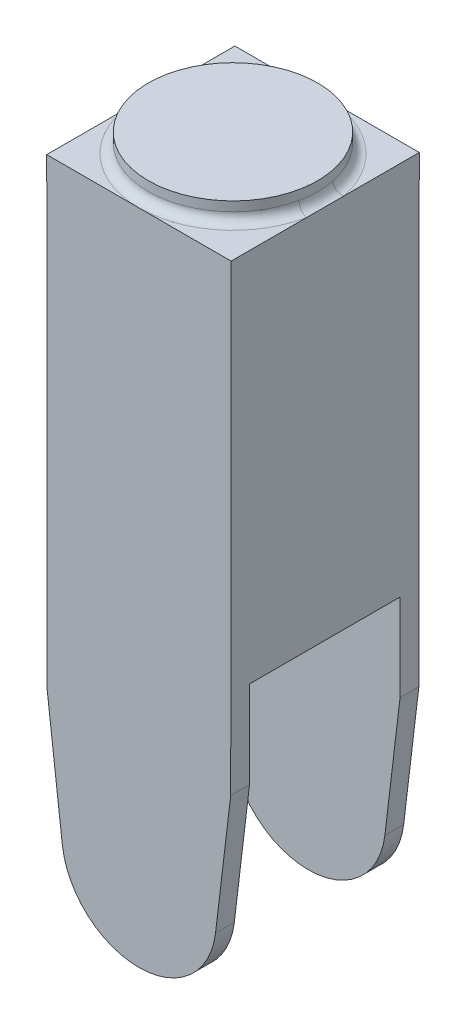
ISO-10303-21;
HEADER;
FILE_DESCRIPTION(('STEP AP214'),'2;1');
FILE_NAME('part.step','',(''),(''),'','','');
FILE_SCHEMA(('AUTOMOTIVE_DESIGN { 1 0 10303 214 1 1 1 1 }'));
ENDSEC;
DATA;
#1=APPLICATION_CONTEXT('core data for automotive mechanical design processes');
#2=APPLICATION_PROTOCOL_DEFINITION('international standard','automotive_design',2000,#1);
#3=PRODUCT_CONTEXT('',#1,'mechanical');
#4=PRODUCT('Part','Part','',(#3));
#5=PRODUCT_RELATED_PRODUCT_CATEGORY('part','',(#4));
#6=PRODUCT_DEFINITION_FORMATION('','',#4);
#7=PRODUCT_DEFINITION_CONTEXT('part definition',#1,'design');
#8=PRODUCT_DEFINITION('design','',#6,#7);
#9=PRODUCT_DEFINITION_SHAPE('','',#8);
#10=(LENGTH_UNIT() NAMED_UNIT(*) SI_UNIT(.MILLI.,.METRE.));
#11=(NAMED_UNIT(*) PLANE_ANGLE_UNIT() SI_UNIT($,.RADIAN.));
#12=(NAMED_UNIT(*) SI_UNIT($,.STERADIAN.) SOLID_ANGLE_UNIT());
#13=UNCERTAINTY_MEASURE_WITH_UNIT(LENGTH_MEASURE(1.E-05),#10,'distance_accuracy_value','');
#14=(GEOMETRIC_REPRESENTATION_CONTEXT(3) GLOBAL_UNCERTAINTY_ASSIGNED_CONTEXT((#13)) GLOBAL_UNIT_ASSIGNED_CONTEXT((#10,
#11,#12)) REPRESENTATION_CONTEXT('',''));
#15=CARTESIAN_POINT('',(0.,0.,0.));
#16=DIRECTION('',(0.,0.,1.));
#17=DIRECTION('',(1.,0.,0.));
#18=AXIS2_PLACEMENT_3D('',#15,#16,#17);
#19=CARTESIAN_POINT('',(-49.,308.649909838737,-50.));
#20=DIRECTION('',(0.,-1.,0.));
#21=DIRECTION('',(0.,0.,-1.));
#22=AXIS2_PLACEMENT_3D('',#19,#20,#21);
#23=PLANE('',#22);
#24=DIRECTION('',(0.,0.,1.));
#25=VECTOR('',#24,1.);
#26=CARTESIAN_POINT('',(-49.,308.649909838737,-50.));
#27=LINE('',#26,#25);
#28=CARTESIAN_POINT('',(-49.,308.649909838737,-50.));
#29=VERTEX_POINT('',#28);
#30=CARTESIAN_POINT('',(-49.,308.649909838737,-9.9498743710662));
#31=VERTEX_POINT('',#30);
#32=EDGE_CURVE('E241',#29,#31,#27,.T.);
#33=ORIENTED_EDGE('',*,*,#32,.T.);
#34=CARTESIAN_POINT('',(0.,308.649909838737,0.));
#35=DIRECTION('',(0.,-1.,0.));
#36=DIRECTION('',(0.,0.,-1.));
#37=AXIS2_PLACEMENT_3D('',#34,#35,#36);
#38=CIRCLE('',#37,50.);
#39=CARTESIAN_POINT('',(0.,308.649909838737,-50.));
#40=VERTEX_POINT('',#39);
#41=EDGE_CURVE('E11',#31,#40,#38,.T.);
#42=ORIENTED_EDGE('',*,*,#41,.T.);
#43=DIRECTION('',(1.,0.,0.));
#44=VECTOR('',#43,1.);
#45=CARTESIAN_POINT('',(-49.,308.649909838737,-50.));
#46=LINE('',#45,#44);
#47=EDGE_CURVE('E224',#29,#40,#46,.T.);
#48=ORIENTED_EDGE('',*,*,#47,.F.);
#49=EDGE_LOOP('',(#33,#42,#48));
#50=FACE_BOUND('',#49,.T.);
#51=ADVANCED_FACE('F39',(#50),#23,.F.);
#52=CARTESIAN_POINT('',(49.,308.649909838737,-50.));
#53=VERTEX_POINT('',#52);
#54=EDGE_CURVE('E223',#40,#53,#46,.T.);
#55=ORIENTED_EDGE('',*,*,#54,.F.);
#56=CARTESIAN_POINT('',(0.,308.649909838737,0.));
#57=DIRECTION('',(0.,-1.,0.));
#58=DIRECTION('',(0.,0.,-1.));
#59=AXIS2_PLACEMENT_3D('',#56,#57,#58);
#60=CIRCLE('',#59,50.);
#61=CARTESIAN_POINT('',(49.,308.649909838737,-9.9498743710662));
#62=VERTEX_POINT('',#61);
#63=EDGE_CURVE('E51',#40,#62,#60,.T.);
#64=ORIENTED_EDGE('',*,*,#63,.T.);
#65=DIRECTION('',(0.,0.,1.));
#66=VECTOR('',#65,1.);
#67=CARTESIAN_POINT('',(49.,308.649909838737,-50.));
#68=LINE('',#67,#66);
#69=EDGE_CURVE('E259',#53,#62,#68,.T.);
#70=ORIENTED_EDGE('',*,*,#69,.F.);
#71=EDGE_LOOP('',(#55,#64,#70));
#72=FACE_BOUND('',#71,.T.);
#73=ADVANCED_FACE('F338',(#72),#23,.F.);
#74=CARTESIAN_POINT('',(49.,308.649909838737,9.94987437106621));
#75=VERTEX_POINT('',#74);
#76=CARTESIAN_POINT('',(49.,308.649909838737,50.));
#77=VERTEX_POINT('',#76);
#78=EDGE_CURVE('E65',#75,#77,#68,.T.);
#79=ORIENTED_EDGE('',*,*,#78,.F.);
#80=CARTESIAN_POINT('',(0.,308.649909838737,0.));
#81=DIRECTION('',(0.,-1.,0.));
#82=DIRECTION('',(0.,0.,-1.));
#83=AXIS2_PLACEMENT_3D('',#80,#81,#82);
#84=CIRCLE('',#83,50.);
#85=CARTESIAN_POINT('',(0.,308.649909838737,50.));
#86=VERTEX_POINT('',#85);
#87=EDGE_CURVE('E382',#75,#86,#84,.T.);
#88=ORIENTED_EDGE('',*,*,#87,.T.);
#89=DIRECTION('',(1.,0.,0.));
#90=VECTOR('',#89,1.);
#91=CARTESIAN_POINT('',(-49.,308.649909838737,50.));
#92=LINE('',#91,#90);
#93=EDGE_CURVE('E204',#86,#77,#92,.T.);
#94=ORIENTED_EDGE('',*,*,#93,.T.);
#95=EDGE_LOOP('',(#79,#88,#94));
#96=FACE_BOUND('',#95,.T.);
#97=ADVANCED_FACE('F342',(#96),#23,.F.);
#98=CARTESIAN_POINT('',(48.7850082070325,62.6500037848344,-50.));
#99=DIRECTION('',(-0.992923964132764,0.118751848199841,0.));
#100=DIRECTION('',(-0.118751848199841,-0.992923964132764,0.));
#101=AXIS2_PLACEMENT_3D('',#98,#99,#100);
#102=PLANE('',#101);
#103=DIRECTION('',(0.,0.,1.));
#104=VECTOR('',#103,1.);
#105=CARTESIAN_POINT('',(40.7098825294433,-4.86882577619352,-50.));
#106=LINE('',#105,#104);
#107=CARTESIAN_POINT('',(40.7098825294433,-4.86882577619352,40.));
#108=VERTEX_POINT('',#107);
#109=CARTESIAN_POINT('',(40.7098825294433,-4.86882577619352,50.));
#110=VERTEX_POINT('',#109);
#111=EDGE_CURVE('E252',#108,#110,#106,.T.);
#112=ORIENTED_EDGE('',*,*,#111,.F.);
#113=DIRECTION('',(0.118751848199841,0.992923964132764,0.));
#114=VECTOR('',#113,1.);
#115=CARTESIAN_POINT('',(48.7850082070325,62.6500037848344,40.));
#116=LINE('',#115,#114);
#117=CARTESIAN_POINT('',(48.7850082070325,62.6500037848344,40.));
#118=VERTEX_POINT('',#117);
#119=EDGE_CURVE('E201',#108,#118,#116,.T.);
#120=ORIENTED_EDGE('',*,*,#119,.T.);
#121=DIRECTION('',(0.,0.,1.));
#122=VECTOR('',#121,1.);
#123=CARTESIAN_POINT('',(48.7850082070325,62.6500037848344,-50.));
#124=LINE('',#123,#122);
#125=CARTESIAN_POINT('',(48.7850082070325,62.6500037848344,50.));
#126=VERTEX_POINT('',#125);
#127=EDGE_CURVE('E256',#118,#126,#124,.T.);
#128=ORIENTED_EDGE('',*,*,#127,.T.);
#129=DIRECTION('',(-0.118751848199841,-0.992923964132764,0.));
#130=VECTOR('',#129,1.);
#131=CARTESIAN_POINT('',(48.7850082070325,62.6500037848344,50.));
#132=LINE('',#131,#130);
#133=EDGE_CURVE('E211',#126,#110,#132,.T.);
#134=ORIENTED_EDGE('',*,*,#133,.T.);
#135=EDGE_LOOP('',(#112,#120,#128,#134));
#136=FACE_BOUND('',#135,.T.);
#137=ADVANCED_FACE('F357',(#136),#102,.F.);
#138=CARTESIAN_POINT('',(0.,0.,-50.));
#139=DIRECTION('',(0.,0.,1.));
#140=DIRECTION('',(1.,0.,0.));
#141=AXIS2_PLACEMENT_3D('',#138,#139,#140);
#142=CYLINDRICAL_SURFACE('',#141,41.);
#143=CARTESIAN_POINT('',(40.7098825294433,-4.86882577619352,-50.));
#144=VERTEX_POINT('',#143);
#145=CARTESIAN_POINT('',(40.7098825294433,-4.86882577619352,-40.));
#146=VERTEX_POINT('',#145);
#147=EDGE_CURVE('E253',#144,#146,#106,.T.);
#148=ORIENTED_EDGE('',*,*,#147,.T.);
#149=CARTESIAN_POINT('',(0.,0.,-40.));
#150=DIRECTION('',(0.,0.,-1.));
#151=DIRECTION('',(-1.,0.,0.));
#152=AXIS2_PLACEMENT_3D('',#149,#150,#151);
#153=CIRCLE('',#152,41.);
#154=CARTESIAN_POINT('',(-40.7098825294432,-4.86882577619352,-40.));
#155=VERTEX_POINT('',#154);
#156=EDGE_CURVE('E194',#155,#146,#153,.F.);
#157=ORIENTED_EDGE('',*,*,#156,.F.);
#158=DIRECTION('',(0.,0.,1.));
#159=VECTOR('',#158,1.);
#160=CARTESIAN_POINT('',(-40.7098825294432,-4.86882577619352,-50.));
#161=LINE('',#160,#159);
#162=CARTESIAN_POINT('',(-40.7098825294432,-4.86882577619352,-50.));
#163=VERTEX_POINT('',#162);
#164=EDGE_CURVE('E249',#163,#155,#161,.T.);
#165=ORIENTED_EDGE('',*,*,#164,.F.);
#166=CARTESIAN_POINT('',(0.,0.,-50.));
#167=DIRECTION('',(0.,0.,1.));
#168=DIRECTION('',(1.,0.,0.));
#169=AXIS2_PLACEMENT_3D('',#166,#167,#168);
#170=CIRCLE('',#169,41.);
#171=EDGE_CURVE('E231',#163,#144,#170,.T.);
#172=ORIENTED_EDGE('',*,*,#171,.T.);
#173=EDGE_LOOP('',(#148,#157,#165,#172));
#174=FACE_BOUND('',#173,.T.);
#175=ADVANCED_FACE('F352',(#174),#142,.T.);
#176=CARTESIAN_POINT('',(-48.7850082070324,62.6500037848344,-50.));
#177=DIRECTION('',(-0.992923964132764,-0.118751848199841,0.));
#178=DIRECTION('',(0.118751848199841,-0.992923964132764,0.));
#179=AXIS2_PLACEMENT_3D('',#176,#177,#178);
#180=PLANE('',#179);
#181=DIRECTION('',(-0.118751848199841,0.992923964132764,0.));
#182=VECTOR('',#181,1.);
#183=CARTESIAN_POINT('',(-48.7850082070324,62.6500037848344,40.));
#184=LINE('',#183,#182);
#185=CARTESIAN_POINT('',(-40.7098825294432,-4.86882577619352,40.));
#186=VERTEX_POINT('',#185);
#187=CARTESIAN_POINT('',(-48.7850082070324,62.6500037848344,40.));
#188=VERTEX_POINT('',#187);
#189=EDGE_CURVE('E197',#186,#188,#184,.T.);
#190=ORIENTED_EDGE('',*,*,#189,.F.);
#191=CARTESIAN_POINT('',(-40.7098825294432,-4.86882577619352,50.));
#192=VERTEX_POINT('',#191);
#193=EDGE_CURVE('E248',#186,#192,#161,.T.);
#194=ORIENTED_EDGE('',*,*,#193,.T.);
#195=DIRECTION('',(0.118751848199841,-0.992923964132764,0.));
#196=VECTOR('',#195,1.);
#197=CARTESIAN_POINT('',(-48.7850082070324,62.6500037848344,50.));
#198=LINE('',#197,#196);
#199=CARTESIAN_POINT('',(-48.7850082070324,62.6500037848344,50.));
#200=VERTEX_POINT('',#199);
#201=EDGE_CURVE('E217',#200,#192,#198,.T.);
#202=ORIENTED_EDGE('',*,*,#201,.F.);
#203=DIRECTION('',(0.,0.,1.));
#204=VECTOR('',#203,1.);
#205=CARTESIAN_POINT('',(-48.7850082070324,62.6500037848344,-50.));
#206=LINE('',#205,#204);
#207=EDGE_CURVE('E243',#188,#200,#206,.T.);
#208=ORIENTED_EDGE('',*,*,#207,.F.);
#209=EDGE_LOOP('',(#190,#194,#202,#208));
#210=FACE_BOUND('',#209,.T.);
#211=ADVANCED_FACE('F345',(#210),#180,.T.);
#212=CARTESIAN_POINT('',(-49.,308.649909838737,50.));
#213=VERTEX_POINT('',#212);
#214=EDGE_CURVE('E205',#213,#86,#92,.T.);
#215=ORIENTED_EDGE('',*,*,#214,.T.);
#216=CARTESIAN_POINT('',(0.,308.649909838737,0.));
#217=DIRECTION('',(0.,-1.,0.));
#218=DIRECTION('',(0.,0.,-1.));
#219=AXIS2_PLACEMENT_3D('',#216,#217,#218);
#220=CIRCLE('',#219,50.);
#221=CARTESIAN_POINT('',(-49.,308.649909838737,9.9498743710662));
#222=VERTEX_POINT('',#221);
#223=EDGE_CURVE('E384',#86,#222,#220,.T.);
#224=ORIENTED_EDGE('',*,*,#223,.T.);
#225=EDGE_CURVE('E240',#222,#213,#27,.T.);
#226=ORIENTED_EDGE('',*,*,#225,.T.);
#227=EDGE_LOOP('',(#215,#224,#226));
#228=FACE_BOUND('',#227,.T.);
#229=ADVANCED_FACE('F287',(#228),#23,.F.);
#230=CARTESIAN_POINT('',(49.,308.649909838737,-50.));
#231=DIRECTION('',(-0.999999618105296,0.000873950377916843,0.));
#232=DIRECTION('',(-0.000873950377916843,-0.999999618105296,0.));
#233=AXIS2_PLACEMENT_3D('',#230,#231,#232);
#234=PLANE('',#233);
#235=ORIENTED_EDGE('',*,*,#127,.F.);
#236=DIRECTION('',(-0.000873950377916812,-0.999999618105296,0.));
#237=VECTOR('',#236,1.);
#238=CARTESIAN_POINT('',(48.8254785631856,108.957370564801,40.));
#239=LINE('',#238,#237);
#240=CARTESIAN_POINT('',(48.8254785631856,108.957370564801,40.));
#241=VERTEX_POINT('',#240);
#242=EDGE_CURVE('E184',#241,#118,#239,.T.);
#243=ORIENTED_EDGE('',*,*,#242,.F.);
#244=DIRECTION('',(0.,0.,1.));
#245=VECTOR('',#244,1.);
#246=CARTESIAN_POINT('',(48.8254785631856,108.957370564801,-40.));
#247=LINE('',#246,#245);
#248=CARTESIAN_POINT('',(48.8254785631856,108.957370564801,-40.));
#249=VERTEX_POINT('',#248);
#250=EDGE_CURVE('E168',#249,#241,#247,.T.);
#251=ORIENTED_EDGE('',*,*,#250,.F.);
#252=DIRECTION('',(0.000873950377916812,0.999999618105296,0.));
#253=VECTOR('',#252,1.);
#254=CARTESIAN_POINT('',(48.8254785631856,108.957370564801,-40.));
#255=LINE('',#254,#253);
#256=CARTESIAN_POINT('',(48.7850082070325,62.6500037848344,-40.));
#257=VERTEX_POINT('',#256);
#258=EDGE_CURVE('E177',#257,#249,#255,.T.);
#259=ORIENTED_EDGE('',*,*,#258,.F.);
#260=CARTESIAN_POINT('',(48.7850082070325,62.6500037848344,-50.));
#261=VERTEX_POINT('',#260);
#262=EDGE_CURVE('E257',#261,#257,#124,.T.);
#263=ORIENTED_EDGE('',*,*,#262,.F.);
#264=DIRECTION('',(-0.000873950377916843,-0.999999618105296,0.));
#265=VECTOR('',#264,1.);
#266=CARTESIAN_POINT('',(49.,308.649909838737,-50.));
#267=LINE('',#266,#265);
#268=EDGE_CURVE('E227',#53,#261,#267,.T.);
#269=ORIENTED_EDGE('',*,*,#268,.F.);
#270=ORIENTED_EDGE('',*,*,#69,.T.);
#271=EDGE_CURVE('E263',#62,#75,#68,.T.);
#272=ORIENTED_EDGE('',*,*,#271,.T.);
#273=ORIENTED_EDGE('',*,*,#78,.T.);
#274=DIRECTION('',(-0.000873950377916843,-0.999999618105296,0.));
#275=VECTOR('',#274,1.);
#276=CARTESIAN_POINT('',(49.,308.649909838737,50.));
#277=LINE('',#276,#275);
#278=EDGE_CURVE('E208',#77,#126,#277,.T.);
#279=ORIENTED_EDGE('',*,*,#278,.T.);
#280=EDGE_LOOP('',(#235,#243,#251,#259,#263,#269,#270,#272,#273,#279));
#281=FACE_BOUND('',#280,.T.);
#282=ADVANCED_FACE('F187',(#281),#234,.F.);
#283=ORIENTED_EDGE('',*,*,#262,.T.);
#284=DIRECTION('',(-0.118751848199841,-0.992923964132764,0.));
#285=VECTOR('',#284,1.);
#286=CARTESIAN_POINT('',(48.7850082070325,62.6500037848344,-40.));
#287=LINE('',#286,#285);
#288=EDGE_CURVE('E180',#257,#146,#287,.T.);
#289=ORIENTED_EDGE('',*,*,#288,.T.);
#290=ORIENTED_EDGE('',*,*,#147,.F.);
#291=DIRECTION('',(-0.118751848199841,-0.992923964132764,0.));
#292=VECTOR('',#291,1.);
#293=CARTESIAN_POINT('',(48.7850082070325,62.6500037848344,-50.));
#294=LINE('',#293,#292);
#295=EDGE_CURVE('E229',#261,#144,#294,.T.);
#296=ORIENTED_EDGE('',*,*,#295,.F.);
#297=EDGE_LOOP('',(#283,#289,#290,#296));
#298=FACE_BOUND('',#297,.T.);
#299=ADVANCED_FACE('F351',(#298),#102,.F.);
#300=CARTESIAN_POINT('',(0.,0.,40.));
#301=DIRECTION('',(0.,0.,1.));
#302=DIRECTION('',(0.,-1.,0.));
#303=AXIS2_PLACEMENT_3D('',#300,#301,#302);
#304=CIRCLE('',#303,41.);
#305=EDGE_CURVE('E199',#108,#186,#304,.F.);
#306=ORIENTED_EDGE('',*,*,#305,.F.);
#307=ORIENTED_EDGE('',*,*,#111,.T.);
#308=CARTESIAN_POINT('',(0.,0.,50.));
#309=DIRECTION('',(0.,0.,1.));
#310=DIRECTION('',(1.,0.,0.));
#311=AXIS2_PLACEMENT_3D('',#308,#309,#310);
#312=CIRCLE('',#311,41.);
#313=EDGE_CURVE('E214',#192,#110,#312,.T.);
#314=ORIENTED_EDGE('',*,*,#313,.F.);
#315=ORIENTED_EDGE('',*,*,#193,.F.);
#316=EDGE_LOOP('',(#306,#307,#314,#315));
#317=FACE_BOUND('',#316,.T.);
#318=ADVANCED_FACE('F367',(#317),#142,.T.);
#319=DIRECTION('',(0.118751848199841,-0.992923964132764,0.));
#320=VECTOR('',#319,1.);
#321=CARTESIAN_POINT('',(-48.7850082070324,62.6500037848344,-40.));
#322=LINE('',#321,#320);
#323=CARTESIAN_POINT('',(-48.7850082070324,62.6500037848344,-40.));
#324=VERTEX_POINT('',#323);
#325=EDGE_CURVE('E191',#324,#155,#322,.T.);
#326=ORIENTED_EDGE('',*,*,#325,.F.);
#327=CARTESIAN_POINT('',(-48.7850082070324,62.6500037848344,-50.));
#328=VERTEX_POINT('',#327);
#329=EDGE_CURVE('E245',#328,#324,#206,.T.);
#330=ORIENTED_EDGE('',*,*,#329,.F.);
#331=DIRECTION('',(0.118751848199841,-0.992923964132764,0.));
#332=VECTOR('',#331,1.);
#333=CARTESIAN_POINT('',(-48.7850082070324,62.6500037848344,-50.));
#334=LINE('',#333,#332);
#335=EDGE_CURVE('E234',#328,#163,#334,.T.);
#336=ORIENTED_EDGE('',*,*,#335,.T.);
#337=ORIENTED_EDGE('',*,*,#164,.T.);
#338=EDGE_LOOP('',(#326,#330,#336,#337));
#339=FACE_BOUND('',#338,.T.);
#340=ADVANCED_FACE('F355',(#339),#180,.T.);
#341=CARTESIAN_POINT('',(-49.,308.649909838737,-50.));
#342=DIRECTION('',(-0.999999618105296,-0.000873950377916843,0.));
#343=DIRECTION('',(0.000873950377916843,-0.999999618105296,0.));
#344=AXIS2_PLACEMENT_3D('',#341,#342,#343);
#345=PLANE('',#344);
#346=DIRECTION('',(-0.000873950377916843,0.999999618105296,0.));
#347=VECTOR('',#346,1.);
#348=CARTESIAN_POINT('',(-49.,308.649909838737,40.));
#349=LINE('',#348,#347);
#350=CARTESIAN_POINT('',(-48.825553148052,109.04271275346,40.));
#351=VERTEX_POINT('',#350);
#352=EDGE_CURVE('E266',#188,#351,#349,.T.);
#353=ORIENTED_EDGE('',*,*,#352,.F.);
#354=ORIENTED_EDGE('',*,*,#207,.T.);
#355=DIRECTION('',(0.000873950377916843,-0.999999618105296,0.));
#356=VECTOR('',#355,1.);
#357=CARTESIAN_POINT('',(-49.,308.649909838737,50.));
#358=LINE('',#357,#356);
#359=EDGE_CURVE('E220',#213,#200,#358,.T.);
#360=ORIENTED_EDGE('',*,*,#359,.F.);
#361=ORIENTED_EDGE('',*,*,#225,.F.);
#362=EDGE_CURVE('E244',#31,#222,#27,.T.);
#363=ORIENTED_EDGE('',*,*,#362,.F.);
#364=ORIENTED_EDGE('',*,*,#32,.F.);
#365=DIRECTION('',(0.000873950377916843,-0.999999618105296,0.));
#366=VECTOR('',#365,1.);
#367=CARTESIAN_POINT('',(-49.,308.649909838737,-50.));
#368=LINE('',#367,#366);
#369=EDGE_CURVE('E237',#29,#328,#368,.T.);
#370=ORIENTED_EDGE('',*,*,#369,.T.);
#371=ORIENTED_EDGE('',*,*,#329,.T.);
#372=DIRECTION('',(0.000873950377916843,-0.999999618105296,0.));
#373=VECTOR('',#372,1.);
#374=CARTESIAN_POINT('',(-49.,308.649909838737,-40.));
#375=LINE('',#374,#373);
#376=CARTESIAN_POINT('',(-48.825553148052,109.04271275346,-40.));
#377=VERTEX_POINT('',#376);
#378=EDGE_CURVE('E262',#377,#324,#375,.T.);
#379=ORIENTED_EDGE('',*,*,#378,.F.);
#380=DIRECTION('',(0.,0.,-1.));
#381=VECTOR('',#380,1.);
#382=CARTESIAN_POINT('',(-48.825553148052,109.04271275346,-49.9999999999999));
#383=LINE('',#382,#381);
#384=EDGE_CURVE('E171',#351,#377,#383,.T.);
#385=ORIENTED_EDGE('',*,*,#384,.F.);
#386=EDGE_LOOP('',(#353,#354,#360,#361,#363,#364,#370,#371,#379,#385));
#387=FACE_BOUND('',#386,.T.);
#388=ADVANCED_FACE('F400',(#387),#345,.T.);
#389=CARTESIAN_POINT('',(0.,0.,-50.));
#390=DIRECTION('',(0.,0.,1.));
#391=DIRECTION('',(1.,0.,0.));
#392=AXIS2_PLACEMENT_3D('',#389,#390,#391);
#393=PLANE('',#392);
#394=ORIENTED_EDGE('',*,*,#47,.T.);
#395=ORIENTED_EDGE('',*,*,#54,.T.);
#396=ORIENTED_EDGE('',*,*,#268,.T.);
#397=ORIENTED_EDGE('',*,*,#295,.T.);
#398=ORIENTED_EDGE('',*,*,#171,.F.);
#399=ORIENTED_EDGE('',*,*,#335,.F.);
#400=ORIENTED_EDGE('',*,*,#369,.F.);
#401=EDGE_LOOP('',(#394,#395,#396,#397,#398,#399,#400));
#402=FACE_BOUND('',#401,.T.);
#403=ADVANCED_FACE('F404',(#402),#393,.F.);
#404=CARTESIAN_POINT('',(0.,0.,50.));
#405=DIRECTION('',(0.,0.,1.));
#406=DIRECTION('',(1.,0.,0.));
#407=AXIS2_PLACEMENT_3D('',#404,#405,#406);
#408=PLANE('',#407);
#409=ORIENTED_EDGE('',*,*,#214,.F.);
#410=ORIENTED_EDGE('',*,*,#359,.T.);
#411=ORIENTED_EDGE('',*,*,#201,.T.);
#412=ORIENTED_EDGE('',*,*,#313,.T.);
#413=ORIENTED_EDGE('',*,*,#133,.F.);
#414=ORIENTED_EDGE('',*,*,#278,.F.);
#415=ORIENTED_EDGE('',*,*,#93,.F.);
#416=EDGE_LOOP('',(#409,#410,#411,#412,#413,#414,#415));
#417=FACE_BOUND('',#416,.T.);
#418=ADVANCED_FACE('F420',(#417),#408,.T.);
#419=CARTESIAN_POINT('',(-49.1744465854667,109.043017669128,40.));
#420=DIRECTION('',(0.,0.,1.));
#421=DIRECTION('',(0.,-1.,0.));
#422=AXIS2_PLACEMENT_3D('',#419,#420,#421);
#423=PLANE('',#422);
#424=ORIENTED_EDGE('',*,*,#119,.F.);
#425=ORIENTED_EDGE('',*,*,#305,.T.);
#426=ORIENTED_EDGE('',*,*,#189,.T.);
#427=ORIENTED_EDGE('',*,*,#352,.T.);
#428=DIRECTION('',(0.999999618105296,-0.000873950377916843,0.));
#429=VECTOR('',#428,1.);
#430=CARTESIAN_POINT('',(-49.1744465854667,109.043017669128,40.));
#431=LINE('',#430,#429);
#432=EDGE_CURVE('E174',#351,#241,#431,.T.);
#433=ORIENTED_EDGE('',*,*,#432,.T.);
#434=ORIENTED_EDGE('',*,*,#242,.T.);
#435=EDGE_LOOP('',(#424,#425,#426,#427,#433,#434));
#436=FACE_BOUND('',#435,.T.);
#437=ADVANCED_FACE('F423',(#436),#423,.F.);
#438=CARTESIAN_POINT('',(-49.1744465854667,109.043017669128,-40.));
#439=DIRECTION('',(0.,0.,-1.));
#440=DIRECTION('',(-1.,0.,0.));
#441=AXIS2_PLACEMENT_3D('',#438,#439,#440);
#442=PLANE('',#441);
#443=ORIENTED_EDGE('',*,*,#258,.T.);
#444=DIRECTION('',(0.999999618105296,-0.000873950377916843,0.));
#445=VECTOR('',#444,1.);
#446=CARTESIAN_POINT('',(-49.1744465854667,109.043017669128,-40.));
#447=LINE('',#446,#445);
#448=EDGE_CURVE('E163',#377,#249,#447,.T.);
#449=ORIENTED_EDGE('',*,*,#448,.F.);
#450=ORIENTED_EDGE('',*,*,#378,.T.);
#451=ORIENTED_EDGE('',*,*,#325,.T.);
#452=ORIENTED_EDGE('',*,*,#156,.T.);
#453=ORIENTED_EDGE('',*,*,#288,.F.);
#454=EDGE_LOOP('',(#443,#449,#450,#451,#452,#453));
#455=FACE_BOUND('',#454,.T.);
#456=ADVANCED_FACE('F178',(#455),#442,.F.);
#457=CARTESIAN_POINT('',(-49.1744465854667,109.043017669128,-40.));
#458=DIRECTION('',(0.000873950377916843,0.999999618105296,0.));
#459=DIRECTION('',(-0.999999618105296,0.000873950377916843,0.));
#460=AXIS2_PLACEMENT_3D('',#457,#458,#459);
#461=PLANE('',#460);
#462=ORIENTED_EDGE('',*,*,#384,.T.);
#463=ORIENTED_EDGE('',*,*,#448,.T.);
#464=ORIENTED_EDGE('',*,*,#250,.T.);
#465=ORIENTED_EDGE('',*,*,#432,.F.);
#466=EDGE_LOOP('',(#462,#463,#464,#465));
#467=FACE_BOUND('',#466,.T.);
#468=ADVANCED_FACE('F165',(#467),#461,.F.);
#469=CARTESIAN_POINT('',(0.,318.649909838737,0.));
#470=DIRECTION('',(0.,-1.,0.));
#471=DIRECTION('',(0.,0.,-1.));
#472=AXIS2_PLACEMENT_3D('',#469,#470,#471);
#473=CYLINDRICAL_SURFACE('',#472,45.);
#474=CARTESIAN_POINT('',(0.,313.649909838737,0.));
#475=DIRECTION('',(0.,-1.,0.));
#476=DIRECTION('',(0.,0.,-1.));
#477=AXIS2_PLACEMENT_3D('',#474,#475,#476);
#478=CIRCLE('',#477,45.);
#479=CARTESIAN_POINT('',(44.1,313.649909838737,-8.95488693395959));
#480=VERTEX_POINT('',#479);
#481=CARTESIAN_POINT('',(-44.1,313.649909838737,-8.95488693395959));
#482=VERTEX_POINT('',#481);
#483=EDGE_CURVE('E268',#480,#482,#478,.F.);
#484=ORIENTED_EDGE('',*,*,#483,.T.);
#485=CARTESIAN_POINT('',(-42.8599361023971,313.456315226646,-13.7122528163113));
#486=CARTESIAN_POINT('',(-43.0334008450423,306.939469150996,-13.1700597948299));
#487=CARTESIAN_POINT('',(-49.,308.649909838737,-15.2358364625681));
#488=CARTESIAN_POINT('',(-42.9368320968301,313.480791547404,-13.4719056673532));
#489=CARTESIAN_POINT('',(-43.0891767069136,307.069038323298,-12.9854205603293));
#490=CARTESIAN_POINT('',(-49.,308.649909838737,-14.9687840748325));
#491=CARTESIAN_POINT('',(-43.0117701462143,313.502214300598,-13.2307037939481));
#492=CARTESIAN_POINT('',(-43.1464916944103,307.191704984569,-12.7919939791192));
#493=CARTESIAN_POINT('',(-49.,308.649909838737,-14.7007819932729));
#494=CARTESIAN_POINT('',(-43.1576545186505,313.539760422951,-12.746791330338));
#495=CARTESIAN_POINT('',(-43.2615820591522,307.421565670202,-12.3940395507079));
#496=CARTESIAN_POINT('',(-49.,308.649909838737,-14.1631014781565));
#497=CARTESIAN_POINT('',(-43.2286012939426,313.555884393505,-12.5040809145364));
#498=CARTESIAN_POINT('',(-43.3194283712484,307.52921411232,-12.1894478568306));
#499=CARTESIAN_POINT('',(-49.,308.649909838737,-13.8934232383814));
#500=CARTESIAN_POINT('',(-43.4352956970442,313.59751237853,-11.7741557899621));
#501=CARTESIAN_POINT('',(-43.4903688430816,307.828973046019,-11.5677615296255));
#502=CARTESIAN_POINT('',(-49.,308.649909838737,-13.0823953221921));
#503=CARTESIAN_POINT('',(-43.5649765390862,313.616295945853,-11.2848999211357));
#504=CARTESIAN_POINT('',(-43.604410665083,308.005374589341,-11.1310321832779));
#505=CARTESIAN_POINT('',(-49.,308.649909838737,-12.538777690154));
#506=CARTESIAN_POINT('',(-43.8076795005776,313.64118112613,-10.3025727582213));
#507=CARTESIAN_POINT('',(-43.8232017108925,308.31431281174,-10.2341727151337));
#508=CARTESIAN_POINT('',(-49.,308.649909838737,-11.4473030646871));
#509=CARTESIAN_POINT('',(-43.9207175816458,313.647294964852,-9.80950560357352));
#510=CARTESIAN_POINT('',(-43.9287006576199,308.448788233545,-9.77272975247242));
#511=CARTESIAN_POINT('',(-49.,308.649909838737,-10.8994506706364));
#512=CARTESIAN_POINT('',(-44.1301225833811,313.651151244535,-8.81976024980774));
#513=CARTESIAN_POINT('',(-44.1270664356719,308.683526738618,-8.83327087211043));
#514=CARTESIAN_POINT('',(-49.,308.649909838737,-9.79973361089838));
#515=CARTESIAN_POINT('',(-44.2264873049584,313.648892582106,-8.32308158334694));
#516=CARTESIAN_POINT('',(-44.2206200117765,308.785035439357,-8.35371956222439));
#517=CARTESIAN_POINT('',(-49.,308.649909838737,-9.2478684259413));
#518=CARTESIAN_POINT('',(-44.4006990946393,313.639656232585,-7.3364818515291));
#519=CARTESIAN_POINT('',(-44.3912767873187,308.959227137932,-7.392336015579));
#520=CARTESIAN_POINT('',(-49.,308.649909838737,-8.15164650169879));
#521=CARTESIAN_POINT('',(-44.4788695403716,313.632771075732,-6.84661696033611));
#522=CARTESIAN_POINT('',(-44.469198529045,309.033185497203,-6.90936311088313));
#523=CARTESIAN_POINT('',(-49.,308.649909838737,-7.60735217815119));
#524=CARTESIAN_POINT('',(-44.6189706963869,313.617163863208,-5.86459325525883));
#525=CARTESIAN_POINT('',(-44.6095366292981,309.160083185733,-5.93569114225381));
#526=CARTESIAN_POINT('',(-49.,308.649909838737,-6.51621472806544));
#527=CARTESIAN_POINT('',(-44.6809013249358,313.608441798291,-5.37243442984197));
#528=CARTESIAN_POINT('',(-44.6724085808244,309.213532287643,-5.4434426279117));
#529=CARTESIAN_POINT('',(-49.,308.649909838737,-5.96937158871333));
#530=CARTESIAN_POINT('',(-44.788466842044,313.591415568193,-4.38626219447434));
#531=CARTESIAN_POINT('',(-44.7818381861609,309.30320210624,-4.45381743494951));
#532=CARTESIAN_POINT('',(-49.,308.649909838737,-4.87362466052704));
#533=CARTESIAN_POINT('',(-44.8340994400428,313.583111461894,-3.89224853369224));
#534=CARTESIAN_POINT('',(-44.8287429909268,309.339747155879,-3.95487809857049));
#535=CARTESIAN_POINT('',(-49.,308.649909838737,-4.32472059299139));
#536=CARTESIAN_POINT('',(-44.9090080602587,313.568625321928,-2.90294507574936));
#537=CARTESIAN_POINT('',(-44.9057400075741,309.398290267462,-2.95415973113768));
#538=CARTESIAN_POINT('',(-49.,308.649909838737,-3.22549452861041));
#539=CARTESIAN_POINT('',(-44.9382836167717,313.562443348685,-2.40765524265774));
#540=CARTESIAN_POINT('',(-44.9360741943552,309.420484896165,-2.4508152281779));
#541=CARTESIAN_POINT('',(-49.,308.649909838737,-2.67517249184194));
#542=CARTESIAN_POINT('',(-44.9837645375608,313.552618255778,-1.33819158598001));
#543=CARTESIAN_POINT('',(-44.983089892427,309.45452360259,-1.3641910619284));
#544=CARTESIAN_POINT('',(-49.,308.649909838737,-1.4868795399778));
#545=CARTESIAN_POINT('',(-44.9971814393198,313.549529099827,-0.763892597452543));
#546=CARTESIAN_POINT('',(-44.9970756023673,309.464339266266,-0.778160216212858));
#547=CARTESIAN_POINT('',(-49.,308.649909838737,-0.848769552725062));
#548=CARTESIAN_POINT('',(-45.0020201782597,313.548430584246,0.384803955444962));
#549=CARTESIAN_POINT('',(-45.0020953095658,309.467887221691,0.391786739358203));
#550=CARTESIAN_POINT('',(-49.,308.649909838737,0.427559950494384));
#551=CARTESIAN_POINT('',(-44.993441778272,313.55042127939,0.959201520811139));
#552=CARTESIAN_POINT('',(-44.9931499797236,309.461634063085,0.978133747955275));
#553=CARTESIAN_POINT('',(-49.,308.649909838737,1.06577946756792));
#554=CARTESIAN_POINT('',(-44.9543013108378,313.559030480788,2.10731330612862));
#555=CARTESIAN_POINT('',(-44.9526299117775,309.432548242682,2.1459275574891));
#556=CARTESIAN_POINT('',(-49.,308.649909838737,2.34145922903179));
#557=CARTESIAN_POINT('',(-44.9237356098086,313.565649751947,2.68102739743133));
#558=CARTESIAN_POINT('',(-44.9208820321831,309.40958998964,2.72980491116438));
#559=CARTESIAN_POINT('',(-49.,308.649909838737,2.97891933047926));
#560=CARTESIAN_POINT('',(-44.8406659328996,313.581940107567,3.82683059730347));
#561=CARTESIAN_POINT('',(-44.8354327295081,309.344999576847,3.88952047893816));
#562=CARTESIAN_POINT('',(-49.,308.649909838737,4.25203399700383));
#563=CARTESIAN_POINT('',(-44.7881617533174,313.591611220365,4.39891969073486));
#564=CARTESIAN_POINT('',(-44.7813704161267,309.303077853417,4.46778896296047));
#565=CARTESIAN_POINT('',(-49.,308.649909838737,4.8876885452609));
#566=CARTESIAN_POINT('',(-44.6598714937175,313.611594533179,5.55344249903698));
#567=CARTESIAN_POINT('',(-44.6509362331147,309.195624014181,5.62582763003564));
#568=CARTESIAN_POINT('',(-49.,308.649909838737,6.17049166559667));
#569=CARTESIAN_POINT('',(-44.5835906667229,313.621916236767,6.13582119074168));
#570=CARTESIAN_POINT('',(-44.5735253044152,309.129047376714,6.20773901222796));
#571=CARTESIAN_POINT('',(-49.,308.649909838737,6.81757910082423));
#572=CARTESIAN_POINT('',(-44.4082927246815,313.639119633412,7.29714908578182));
#573=CARTESIAN_POINT('',(-44.3987639585268,308.966596644415,7.35494566567574));
#574=CARTESIAN_POINT('',(-49.,308.649909838737,8.10794342864645));
#575=CARTESIAN_POINT('',(-44.3092770707579,313.646001547446,7.87609850705806));
#576=CARTESIAN_POINT('',(-44.3006147810236,308.869784641419,7.92280606179278));
#577=CARTESIAN_POINT('',(-49.,308.649909838737,8.75122056339755));
#578=CARTESIAN_POINT('',(-44.0886414388524,313.651399829225,9.02975855986132));
#579=CARTESIAN_POINT('',(-44.0871875208591,308.638682504797,9.03591309321937));
#580=CARTESIAN_POINT('',(-49.,308.649909838737,10.0330650665128));
#581=CARTESIAN_POINT('',(-43.9670212438172,313.649916116636,9.60446915063116));
#582=CARTESIAN_POINT('',(-43.9709129117515,308.502854506142,9.5836437977647));
#583=CARTESIAN_POINT('',(-49.,308.649909838737,10.6716323895913));
#584=CARTESIAN_POINT('',(-43.7678092520701,313.63681330773,10.4625593913894));
#585=CARTESIAN_POINT('',(-43.7885184906408,308.26458746432,10.375434591005));
#586=CARTESIAN_POINT('',(-49.,308.649909838737,11.6250659904334));
#587=CARTESIAN_POINT('',(-43.6985965052233,313.630631064069,10.7479699558681));
#588=CARTESIAN_POINT('',(-43.725480910833,308.178039898344,10.6378524394337));
#589=CARTESIAN_POINT('',(-49.,308.649909838737,11.9421888398537));
#590=CARTESIAN_POINT('',(-43.5546203208295,313.613701438563,11.3173003463242));
#591=CARTESIAN_POINT('',(-43.5970529290358,307.990779439229,11.1533815975411));
#592=CARTESIAN_POINT('',(-49.,308.649909838737,12.5747781625822));
#593=CARTESIAN_POINT('',(-43.4798564270492,313.602953681147,11.601220047714));
#594=CARTESIAN_POINT('',(-43.5315180680268,307.889668347057,11.4067451549437));
#595=CARTESIAN_POINT('',(-49.,308.649909838737,12.8902444974596));
#596=CARTESIAN_POINT('',(-43.4023425980896,313.589454745745,11.8843029664366));
#597=CARTESIAN_POINT('',(-43.4659142438392,307.781432194816,11.6521346721629));
#598=CARTESIAN_POINT('',(-49.,308.649909838737,13.2047810738185));
#599=(BOUNDED_SURFACE() B_SPLINE_SURFACE(3,2,((#485,#486,#487),(#488,#489,#490),(#491,#492,
#493),(#494,#495,#496),(#497,#498,#499),(#500,#501,#502),(#503,#504,#505),(#506,#507,#508),
(#509,#510,#511),(#512,#513,#514),(#515,#516,#517),(#518,#519,#520),(#521,#522,#523),(#524,#525,
#526),(#527,#528,#529),(#530,#531,#532),(#533,#534,#535),(#536,#537,#538),(#539,#540,#541),
(#542,#543,#544),(#545,#546,#547),(#548,#549,#550),(#551,#552,#553),(#554,#555,#556),(#557,#558,
#559),(#560,#561,#562),(#563,#564,#565),(#566,#567,#568),(#569,#570,#571),(#572,#573,#574),
(#575,#576,#577),(#578,#579,#580),(#581,#582,#583),(#584,#585,#586),(#587,#588,#589),(#590,#591,
#592),(#593,#594,#595),(#596,#597,#598)),.UNSPECIFIED.,.F.,.F.,
.F.) B_SPLINE_SURFACE_WITH_KNOTS((4,2,2,2,2,2,2,2,2,2,2,2,2,2,2,2,2,2,4),(3,3),(0.,
0.844293750584523,1.688491643128,3.3760200240667,5.06191924965549,6.74804066335568,
8.40140533717051,10.0547783321169,11.7083836043348,13.3620359542219,15.2764122538494,
17.1908091956911,19.10552258011,21.0202537433539,22.9778361802002,24.9352928422214,
26.8927683010955,27.8718037835814,28.8509198195242),(0.,1.),
.UNSPECIFIED.) GEOMETRIC_REPRESENTATION_ITEM() RATIONAL_B_SPLINE_SURFACE(((1.,0.607262508749687,
1.),(1.,0.613768180140317,1.),(1.,0.620041293478902,1.),(1.,0.632143455655292,1.),(1.,
0.637972554829702,1.),(1.,0.654821761312182,1.),(1.,0.665210416393096,1.),(1.,0.68442397482352,
1.),(1.,0.693250378150889,1.),(1.,0.709451028973644,1.),(1.,0.716825084933133,1.),(1.,
0.73006202381648,1.),(1.,0.735951481602275,1.),(1.,0.746451993882364,1.),(1.,0.751063041942501,
1.),(1.,0.759042479567932,1.),(1.,0.762410694464961,1.),(1.,0.767927170499918,1.),(1.,
0.770075396903379,1.),(1.,0.773409610526415,1.),(1.,0.774390484306512,1.),(1.,0.774744446831514,
1.),(1.,0.774117518239984,1.),(1.,0.77125034828329,1.),(1.,0.769009840260753,1.),(1.,
0.76289574965322,1.),(1.,0.759022151904714,1.),(1.,0.749500241151606,1.),(1.,0.743814150509538,
1.),(1.,0.730635899231629,1.),(1.,0.7231438546594,1.),(1.,0.706261257107706,1.),(1.,
0.696870685898139,1.),(1.,0.681261070998464,1.),(1.,0.67580296058493,1.),(1.,0.664355609746961,
1.),(1.,0.658366325658957,1.),(1.,0.65210018624762,1.))) REPRESENTATION_ITEM('') SURFACE());
#600=CARTESIAN_POINT('',(-42.8599361023971,313.456315226646,-13.7122528163113));
#601=CARTESIAN_POINT('',(-42.9368320968301,313.480791547404,-13.4719056673532));
#602=CARTESIAN_POINT('',(-43.0117701462143,313.502214300598,-13.2307037939481));
#603=CARTESIAN_POINT('',(-43.1576545186505,313.539760422951,-12.746791330338));
#604=CARTESIAN_POINT('',(-43.2286012939426,313.555884393505,-12.5040809145364));
#605=CARTESIAN_POINT('',(-43.4352956970442,313.59751237853,-11.7741557899621));
#606=CARTESIAN_POINT('',(-43.5649765390862,313.616295945853,-11.2848999211357));
#607=CARTESIAN_POINT('',(-43.8076795005776,313.64118112613,-10.3025727582213));
#608=CARTESIAN_POINT('',(-43.9207175816458,313.647294964852,-9.80950560357352));
#609=CARTESIAN_POINT('',(-44.1301225833811,313.651151244535,-8.81976024980774));
#610=CARTESIAN_POINT('',(-44.2264873049584,313.648892582106,-8.32308158334694));
#611=CARTESIAN_POINT('',(-44.4006990946393,313.639656232585,-7.3364818515291));
#612=CARTESIAN_POINT('',(-44.4788695403716,313.632771075732,-6.84661696033611));
#613=CARTESIAN_POINT('',(-44.6189706963869,313.617163863208,-5.86459325525883));
#614=CARTESIAN_POINT('',(-44.6809013249358,313.608441798291,-5.37243442984197));
#615=CARTESIAN_POINT('',(-44.788466842044,313.591415568193,-4.38626219447434));
#616=CARTESIAN_POINT('',(-44.8340994400428,313.583111461894,-3.89224853369224));
#617=CARTESIAN_POINT('',(-44.9090080602587,313.568625321928,-2.90294507574936));
#618=CARTESIAN_POINT('',(-44.9382836167717,313.562443348685,-2.40765524265774));
#619=CARTESIAN_POINT('',(-44.9837645375608,313.552618255778,-1.33819158598001));
#620=CARTESIAN_POINT('',(-44.9971814393198,313.549529099827,-0.763892597452542));
#621=CARTESIAN_POINT('',(-45.0020201782597,313.548430584246,0.384803955444962));
#622=CARTESIAN_POINT('',(-44.993441778272,313.55042127939,0.959201520811139));
#623=CARTESIAN_POINT('',(-44.9543013108378,313.559030480788,2.10731330612862));
#624=CARTESIAN_POINT('',(-44.9237356098086,313.565649751947,2.68102739743133));
#625=CARTESIAN_POINT('',(-44.8406659328996,313.581940107567,3.82683059730347));
#626=CARTESIAN_POINT('',(-44.7881617533174,313.591611220364,4.39891969073486));
#627=CARTESIAN_POINT('',(-44.6598714937175,313.611594533179,5.55344249903698));
#628=CARTESIAN_POINT('',(-44.5835906667229,313.621916236767,6.13582119074168));
#629=CARTESIAN_POINT('',(-44.4082927246815,313.639119633412,7.29714908578182));
#630=CARTESIAN_POINT('',(-44.3092770707579,313.646001547446,7.87609850705806));
#631=CARTESIAN_POINT('',(-44.0886414388524,313.651399829225,9.02975855986132));
#632=CARTESIAN_POINT('',(-43.9670212438172,313.649916116636,9.60446915063116));
#633=CARTESIAN_POINT('',(-43.7678092520701,313.63681330773,10.4625593913894));
#634=CARTESIAN_POINT('',(-43.6985965052233,313.630631064069,10.7479699558681));
#635=CARTESIAN_POINT('',(-43.5546203208295,313.613701438562,11.3173003463242));
#636=CARTESIAN_POINT('',(-43.4798564270492,313.602953681147,11.601220047714));
#637=CARTESIAN_POINT('',(-43.4023425980896,313.589454745745,11.8843029664366));
#638=B_SPLINE_CURVE_WITH_KNOTS('',3,(#600,#601,#602,#603,#604,#605,#606,#607,#608,#609,#610,
#611,#612,#613,#614,#615,#616,#617,#618,#619,#620,#621,#622,#623,#624,#625,#626,#627,#628,#629,
#630,#631,#632,#633,#634,#635,#636,#637),.UNSPECIFIED.,.F.,.F.,(4,2,2,2,2,2,2,2,2,2,2,2,2,2,2,2,
2,2,4),(0.,0.844293750584523,1.688491643128,3.3760200240667,5.06191924965549,6.74804066335568,
8.40140533717051,10.0547783321169,11.7083836043348,13.3620359542219,15.2764122538494,
17.1908091956911,19.10552258011,21.0202537433539,22.9778361802002,24.9352928422214,
26.8927683010955,27.8718037835814,28.8509198195242),.UNSPECIFIED.);
#639=CARTESIAN_POINT('',(-44.1,313.649909838737,8.95488693395959));
#640=VERTEX_POINT('',#639);
#641=EDGE_CURVE('E395',#482,#640,#638,.T.);
#642=ORIENTED_EDGE('',*,*,#641,.T.);
#643=CARTESIAN_POINT('',(0.,313.649909838737,0.));
#644=DIRECTION('',(0.,-1.,0.));
#645=DIRECTION('',(0.,0.,-1.));
#646=AXIS2_PLACEMENT_3D('',#643,#644,#645);
#647=CIRCLE('',#646,45.);
#648=CARTESIAN_POINT('',(44.1,313.649909838737,8.95488693395959));
#649=VERTEX_POINT('',#648);
#650=EDGE_CURVE('E277',#640,#649,#647,.F.);
#651=ORIENTED_EDGE('',*,*,#650,.T.);
#652=CARTESIAN_POINT('',(42.8599361023973,313.456315226646,13.7122528163109));
#653=CARTESIAN_POINT('',(43.0334008450425,306.939469150996,13.1700597948295));
#654=CARTESIAN_POINT('',(49.,308.649909838737,15.2358364625676));
#655=CARTESIAN_POINT('',(42.9368320968303,313.480791547404,13.4719056673528));
#656=CARTESIAN_POINT('',(43.0891767069138,307.069038323299,12.9854205603289));
#657=CARTESIAN_POINT('',(49.,308.649909838737,14.968784074832));
#658=CARTESIAN_POINT('',(43.0117701462145,313.502214300598,13.2307037939477));
#659=CARTESIAN_POINT('',(43.1464916944105,307.191704984569,12.7919939791188));
#660=CARTESIAN_POINT('',(49.,308.649909838737,14.7007819932723));
#661=CARTESIAN_POINT('',(43.1576545186507,313.539760422951,12.7467913303375));
#662=CARTESIAN_POINT('',(43.2615820591524,307.421565670202,12.3940395507074));
#663=CARTESIAN_POINT('',(49.,308.649909838737,14.1631014781559));
#664=CARTESIAN_POINT('',(43.2286012939428,313.555884393505,12.5040809145359));
#665=CARTESIAN_POINT('',(43.3194283712486,307.52921411232,12.1894478568302));
#666=CARTESIAN_POINT('',(49.,308.649909838737,13.8934232383808));
#667=CARTESIAN_POINT('',(43.4352956970444,313.59751237853,11.7741557899615));
#668=CARTESIAN_POINT('',(43.4903688430818,307.828973046019,11.567761529625));
#669=CARTESIAN_POINT('',(49.,308.649909838737,13.0823953221915));
#670=CARTESIAN_POINT('',(43.5649765390864,313.616295945853,11.2848999211351));
#671=CARTESIAN_POINT('',(43.6044106650833,308.005374589341,11.1310321832774));
#672=CARTESIAN_POINT('',(49.,308.649909838737,12.5387776901533));
#673=CARTESIAN_POINT('',(43.8076795005778,313.64118112613,10.3025727582207));
#674=CARTESIAN_POINT('',(43.8232017108928,308.31431281174,10.2341727151331));
#675=CARTESIAN_POINT('',(49.,308.649909838737,11.4473030646864));
#676=CARTESIAN_POINT('',(43.920717581646,313.647294964852,9.80950560357287));
#677=CARTESIAN_POINT('',(43.9287006576201,308.448788233545,9.77272975247179));
#678=CARTESIAN_POINT('',(49.,308.649909838737,10.8994506706357));
#679=CARTESIAN_POINT('',(44.1301225833813,313.651151244535,8.81976024980704));
#680=CARTESIAN_POINT('',(44.1270664356721,308.683526738618,8.83327087210973));
#681=CARTESIAN_POINT('',(49.,308.649909838737,9.79973361089757));
#682=CARTESIAN_POINT('',(44.2264873049586,313.648892582106,8.32308158334621));
#683=CARTESIAN_POINT('',(44.2206200117767,308.785035439357,8.35371956222365));
#684=CARTESIAN_POINT('',(49.,308.649909838737,9.24786842594045));
#685=CARTESIAN_POINT('',(44.4006990946395,313.639656232585,7.33648185152831));
#686=CARTESIAN_POINT('',(44.3912767873189,308.959227137932,7.39233601557819));
#687=CARTESIAN_POINT('',(49.,308.649909838737,8.15164650169788));
#688=CARTESIAN_POINT('',(44.4788695403718,313.632771075732,6.8466169603353));
#689=CARTESIAN_POINT('',(44.4691985290452,309.033185497204,6.9093631108823));
#690=CARTESIAN_POINT('',(49.,308.649909838737,7.60735217815026));
#691=CARTESIAN_POINT('',(44.6189706963871,313.617163863208,5.86459325525796));
#692=CARTESIAN_POINT('',(44.6095366292983,309.160083185733,5.93569114225293));
#693=CARTESIAN_POINT('',(49.,308.649909838737,6.51621472806445));
#694=CARTESIAN_POINT('',(44.6809013249359,313.608441798291,5.37243442984107));
#695=CARTESIAN_POINT('',(44.6724085808246,309.213532287643,5.44344262791079));
#696=CARTESIAN_POINT('',(49.,308.649909838737,5.96937158871231));
#697=CARTESIAN_POINT('',(44.7884668420442,313.591415568193,4.3862621944734));
#698=CARTESIAN_POINT('',(44.7818381861611,309.30320210624,4.45381743494853));
#699=CARTESIAN_POINT('',(49.,308.649909838737,4.87362466052596));
#700=CARTESIAN_POINT('',(44.834099440043,313.583111461894,3.89224853369127));
#701=CARTESIAN_POINT('',(44.828742990927,309.339747155879,3.95487809856949));
#702=CARTESIAN_POINT('',(49.,308.649909838737,4.32472059299028));
#703=CARTESIAN_POINT('',(44.9090080602588,313.568625321928,2.90294507574832));
#704=CARTESIAN_POINT('',(44.9057400075742,309.398290267462,2.95415973113662));
#705=CARTESIAN_POINT('',(49.,308.649909838737,3.22549452860924));
#706=CARTESIAN_POINT('',(44.9382836167718,313.562443348685,2.40765524265668));
#707=CARTESIAN_POINT('',(44.9360741943554,309.420484896165,2.4508152281768));
#708=CARTESIAN_POINT('',(49.,308.649909838737,2.67517249184075));
#709=CARTESIAN_POINT('',(44.9837645375609,313.552618255778,1.33819158597892));
#710=CARTESIAN_POINT('',(44.9830898924271,309.45452360259,1.36419106192726));
#711=CARTESIAN_POINT('',(49.,308.649909838737,1.48687953997656));
#712=CARTESIAN_POINT('',(44.9971814393199,313.549529099827,0.763892597451442));
#713=CARTESIAN_POINT('',(44.9970756023674,309.464339266266,0.778160216211711));
#714=CARTESIAN_POINT('',(49.,308.649909838737,0.848769552723808));
#715=CARTESIAN_POINT('',(45.0020201782597,313.548430584246,-0.384803955446078));
#716=CARTESIAN_POINT('',(45.0020953095659,309.467887221691,-0.391786739359368));
#717=CARTESIAN_POINT('',(49.,308.649909838737,-0.427559950495656));
#718=CARTESIAN_POINT('',(44.993441778272,313.55042127939,-0.959201520812264));
#719=CARTESIAN_POINT('',(44.9931499797236,309.461634063085,-0.978133747956444));
#720=CARTESIAN_POINT('',(49.,308.649909838737,-1.06577946756919));
#721=CARTESIAN_POINT('',(44.9543013108379,313.559030480788,-2.10731330612976));
#722=CARTESIAN_POINT('',(44.9526299117775,309.432548242682,-2.14592755749028));
#723=CARTESIAN_POINT('',(49.,308.649909838737,-2.34145922903308));
#724=CARTESIAN_POINT('',(44.9237356098086,313.565649751947,-2.68102739743248));
#725=CARTESIAN_POINT('',(44.9208820321831,309.40958998964,-2.72980491116556));
#726=CARTESIAN_POINT('',(49.,308.649909838737,-2.97891933048056));
#727=CARTESIAN_POINT('',(44.8406659328996,313.581940107567,-3.82683059730463));
#728=CARTESIAN_POINT('',(44.8354327295081,309.344999576847,-3.88952047893936));
#729=CARTESIAN_POINT('',(49.,308.649909838737,-4.25203399700515));
#730=CARTESIAN_POINT('',(44.7881617533173,313.591611220365,-4.39891969073603));
#731=CARTESIAN_POINT('',(44.7813704161266,309.303077853417,-4.46778896296167));
#732=CARTESIAN_POINT('',(49.,308.649909838737,-4.88768854526223));
#733=CARTESIAN_POINT('',(44.6598714937175,313.611594533179,-5.55344249903816));
#734=CARTESIAN_POINT('',(44.6509362331146,309.195624014181,-5.62582763003685));
#735=CARTESIAN_POINT('',(49.,308.649909838737,-6.17049166559801));
#736=CARTESIAN_POINT('',(44.5835906667228,313.621916236767,-6.13582119074287));
#737=CARTESIAN_POINT('',(44.5735253044151,309.129047376714,-6.20773901222917));
#738=CARTESIAN_POINT('',(49.,308.649909838737,-6.81757910082558));
#739=CARTESIAN_POINT('',(44.4082927246813,313.639119633412,-7.29714908578302));
#740=CARTESIAN_POINT('',(44.3987639585267,308.966596644414,-7.35494566567694));
#741=CARTESIAN_POINT('',(49.,308.649909838737,-8.10794342864781));
#742=CARTESIAN_POINT('',(44.3092770707578,313.646001547446,-7.87609850705927));
#743=CARTESIAN_POINT('',(44.3006147810234,308.869784641419,-7.92280606179399));
#744=CARTESIAN_POINT('',(49.,308.649909838737,-8.75122056339892));
#745=CARTESIAN_POINT('',(44.0886414388522,313.651399829225,-9.02975855986254));
#746=CARTESIAN_POINT('',(44.0871875208589,308.638682504797,-9.03591309322057));
#747=CARTESIAN_POINT('',(49.,308.649909838737,-10.0330650665142));
#748=CARTESIAN_POINT('',(43.967021243817,313.649916116636,-9.60446915063239));
#749=CARTESIAN_POINT('',(43.9709129117513,308.502854506141,-9.58364379776588));
#750=CARTESIAN_POINT('',(49.,308.649909838737,-10.6716323895927));
#751=CARTESIAN_POINT('',(43.7678092520698,313.636813307729,-10.4625593913907));
#752=CARTESIAN_POINT('',(43.7885184906406,308.264587464319,-10.3754345910061));
#753=CARTESIAN_POINT('',(49.,308.649909838737,-11.6250659904348));
#754=CARTESIAN_POINT('',(43.6985965052231,313.630631064069,-10.7479699558693));
#755=CARTESIAN_POINT('',(43.7254809108328,308.178039898344,-10.6378524394349));
#756=CARTESIAN_POINT('',(49.,308.649909838737,-11.9421888398551));
#757=CARTESIAN_POINT('',(43.5546203208293,313.613701438562,-11.3173003463255));
#758=CARTESIAN_POINT('',(43.5970529290356,307.990779439228,-11.1533815975423));
#759=CARTESIAN_POINT('',(49.,308.649909838737,-12.5747781625836));
#760=CARTESIAN_POINT('',(43.4798564270489,313.602953681147,-11.6012200477153));
#761=CARTESIAN_POINT('',(43.5315180680266,307.889668347056,-11.4067451549449));
#762=CARTESIAN_POINT('',(49.,308.649909838737,-12.890244497461));
#763=CARTESIAN_POINT('',(43.4023425980893,313.589454745745,-11.8843029664379));
#764=CARTESIAN_POINT('',(43.465914243839,307.781432194816,-11.652134672164));
#765=CARTESIAN_POINT('',(49.,308.649909838737,-13.2047810738199));
#766=(BOUNDED_SURFACE() B_SPLINE_SURFACE(3,2,((#652,#653,#654),(#655,#656,#657),(#658,#659,
#660),(#661,#662,#663),(#664,#665,#666),(#667,#668,#669),(#670,#671,#672),(#673,#674,#675),
(#676,#677,#678),(#679,#680,#681),(#682,#683,#684),(#685,#686,#687),(#688,#689,#690),(#691,#692,
#693),(#694,#695,#696),(#697,#698,#699),(#700,#701,#702),(#703,#704,#705),(#706,#707,#708),
(#709,#710,#711),(#712,#713,#714),(#715,#716,#717),(#718,#719,#720),(#721,#722,#723),(#724,#725,
#726),(#727,#728,#729),(#730,#731,#732),(#733,#734,#735),(#736,#737,#738),(#739,#740,#741),
(#742,#743,#744),(#745,#746,#747),(#748,#749,#750),(#751,#752,#753),(#754,#755,#756),(#757,#758,
#759),(#760,#761,#762),(#763,#764,#765)),.UNSPECIFIED.,.F.,.F.,
.F.) B_SPLINE_SURFACE_WITH_KNOTS((4,2,2,2,2,2,2,2,2,2,2,2,2,2,2,2,2,2,4),(3,3),(0.,
0.844293750584568,1.68849164312809,3.37602002406688,5.06191924965576,6.74804066335604,
8.40140533717096,10.0547783321175,11.7083836043354,13.3620359542226,15.2764122538501,
17.1908091956919,19.1055225801108,21.0202537433548,22.9778361802011,24.9352928422223,
26.8927683010964,27.8718037835823,28.8509198195251),(0.,1.),
.UNSPECIFIED.) GEOMETRIC_REPRESENTATION_ITEM() RATIONAL_B_SPLINE_SURFACE(((1.,0.6072625087497,
1.),(1.,0.61376818014033,1.),(1.,0.620041293478915,1.),(1.,0.632143455655305,1.),(1.,
0.637972554829715,1.),(1.,0.654821761312194,1.),(1.,0.665210416393109,1.),(1.,0.684423974823533,
1.),(1.,0.693250378150901,1.),(1.,0.709451028973655,1.),(1.,0.716825084933144,1.),(1.,
0.73006202381649,1.),(1.,0.735951481602284,1.),(1.,0.746451993882372,1.),(1.,0.751063041942509,
1.),(1.,0.759042479567939,1.),(1.,0.762410694464968,1.),(1.,0.767927170499922,1.),(1.,
0.770075396903383,1.),(1.,0.773409610526417,1.),(1.,0.774390484306513,1.),(1.,0.774744446831514,
1.),(1.,0.774117518239983,1.),(1.,0.771250348283287,1.),(1.,0.769009840260748,1.),(1.,
0.762895749653212,1.),(1.,0.759022151904705,1.),(1.,0.749500241151596,1.),(1.,0.743814150509526,
1.),(1.,0.730635899231615,1.),(1.,0.723143854659385,1.),(1.,0.706261257107686,1.),(1.,
0.696870685898118,1.),(1.,0.68126107099844,1.),(1.,0.675802960584906,1.),(1.,0.664355609746935,
1.),(1.,0.65836632565893,1.),(1.,0.652100186247591,1.))) REPRESENTATION_ITEM('') SURFACE());
#767=CARTESIAN_POINT('',(42.8599361023973,313.456315226646,13.7122528163109));
#768=CARTESIAN_POINT('',(42.9368320968303,313.480791547404,13.4719056673528));
#769=CARTESIAN_POINT('',(43.0117701462145,313.502214300598,13.2307037939477));
#770=CARTESIAN_POINT('',(43.1576545186507,313.539760422951,12.7467913303375));
#771=CARTESIAN_POINT('',(43.2286012939428,313.555884393505,12.5040809145359));
#772=CARTESIAN_POINT('',(43.4352956970444,313.59751237853,11.7741557899615));
#773=CARTESIAN_POINT('',(43.5649765390864,313.616295945853,11.2848999211351));
#774=CARTESIAN_POINT('',(43.8076795005778,313.64118112613,10.3025727582207));
#775=CARTESIAN_POINT('',(43.920717581646,313.647294964853,9.80950560357287));
#776=CARTESIAN_POINT('',(44.1301225833813,313.651151244535,8.81976024980704));
#777=CARTESIAN_POINT('',(44.2264873049586,313.648892582106,8.32308158334621));
#778=CARTESIAN_POINT('',(44.4006990946395,313.639656232585,7.33648185152831));
#779=CARTESIAN_POINT('',(44.4788695403718,313.632771075732,6.8466169603353));
#780=CARTESIAN_POINT('',(44.6189706963871,313.617163863208,5.86459325525796));
#781=CARTESIAN_POINT('',(44.6809013249359,313.608441798291,5.37243442984107));
#782=CARTESIAN_POINT('',(44.7884668420442,313.591415568193,4.3862621944734));
#783=CARTESIAN_POINT('',(44.834099440043,313.583111461894,3.89224853369127));
#784=CARTESIAN_POINT('',(44.9090080602588,313.568625321928,2.90294507574833));
#785=CARTESIAN_POINT('',(44.9382836167718,313.562443348685,2.40765524265668));
#786=CARTESIAN_POINT('',(44.9837645375609,313.552618255778,1.33819158597892));
#787=CARTESIAN_POINT('',(44.9971814393199,313.549529099827,0.763892597451442));
#788=CARTESIAN_POINT('',(45.0020201782597,313.548430584246,-0.384803955446078));
#789=CARTESIAN_POINT('',(44.993441778272,313.55042127939,-0.959201520812264));
#790=CARTESIAN_POINT('',(44.9543013108379,313.559030480788,-2.10731330612976));
#791=CARTESIAN_POINT('',(44.9237356098086,313.565649751947,-2.68102739743248));
#792=CARTESIAN_POINT('',(44.8406659328996,313.581940107567,-3.82683059730463));
#793=CARTESIAN_POINT('',(44.7881617533173,313.591611220365,-4.39891969073603));
#794=CARTESIAN_POINT('',(44.6598714937175,313.611594533179,-5.55344249903816));
#795=CARTESIAN_POINT('',(44.5835906667228,313.621916236767,-6.13582119074287));
#796=CARTESIAN_POINT('',(44.4082927246813,313.639119633412,-7.29714908578302));
#797=CARTESIAN_POINT('',(44.3092770707578,313.646001547446,-7.87609850705927));
#798=CARTESIAN_POINT('',(44.0886414388522,313.651399829225,-9.02975855986254));
#799=CARTESIAN_POINT('',(43.967021243817,313.649916116636,-9.60446915063239));
#800=CARTESIAN_POINT('',(43.7678092520698,313.63681330773,-10.4625593913907));
#801=CARTESIAN_POINT('',(43.6985965052231,313.630631064069,-10.7479699558693));
#802=CARTESIAN_POINT('',(43.5546203208293,313.613701438562,-11.3173003463255));
#803=CARTESIAN_POINT('',(43.4798564270489,313.602953681147,-11.6012200477153));
#804=CARTESIAN_POINT('',(43.4023425980893,313.589454745745,-11.8843029664379));
#805=B_SPLINE_CURVE_WITH_KNOTS('',3,(#767,#768,#769,#770,#771,#772,#773,#774,#775,#776,#777,
#778,#779,#780,#781,#782,#783,#784,#785,#786,#787,#788,#789,#790,#791,#792,#793,#794,#795,#796,
#797,#798,#799,#800,#801,#802,#803,#804),.UNSPECIFIED.,.F.,.F.,(4,2,2,2,2,2,2,2,2,2,2,2,2,2,2,2,
2,2,4),(0.,0.844293750584568,1.68849164312809,3.37602002406688,5.06191924965576,
6.74804066335604,8.40140533717096,10.0547783321175,11.7083836043354,13.3620359542226,
15.2764122538501,17.1908091956919,19.1055225801108,21.0202537433548,22.9778361802011,
24.9352928422223,26.8927683010964,27.8718037835823,28.8509198195251),.UNSPECIFIED.);
#806=EDGE_CURVE('E270',#649,#480,#805,.T.);
#807=ORIENTED_EDGE('',*,*,#806,.T.);
#808=EDGE_LOOP('',(#484,#642,#651,#807));
#809=FACE_BOUND('',#808,.T.);
#810=CARTESIAN_POINT('',(0.,318.649909838737,0.));
#811=DIRECTION('',(0.,1.,0.));
#812=DIRECTION('',(0.,0.,1.));
#813=AXIS2_PLACEMENT_3D('',#810,#811,#812);
#814=CIRCLE('',#813,45.);
#815=CARTESIAN_POINT('',(0.,318.649909838737,45.));
#816=VERTEX_POINT('',#815);
#817=EDGE_CURVE('E310',#816,#816,#814,.T.);
#818=ORIENTED_EDGE('',*,*,#817,.F.);
#819=EDGE_LOOP('',(#818));
#820=FACE_BOUND('',#819,.T.);
#821=ADVANCED_FACE('F279',(#809,#820),#473,.T.);
#822=CARTESIAN_POINT('',(0.,318.649909838737,0.));
#823=DIRECTION('',(0.,1.,0.));
#824=DIRECTION('',(0.,0.,1.));
#825=AXIS2_PLACEMENT_3D('',#822,#823,#824);
#826=PLANE('',#825);
#827=ORIENTED_EDGE('',*,*,#817,.T.);
#828=EDGE_LOOP('',(#827));
#829=FACE_BOUND('',#828,.T.);
#830=ADVANCED_FACE('F298',(#829),#826,.T.);
#831=CARTESIAN_POINT('',(49.,313.649909838737,9.94987437106622));
#832=DIRECTION('',(-0.198997487421324,0.,0.98));
#833=DIRECTION('',(0.98,0.,0.198997487421324));
#834=AXIS2_PLACEMENT_3D('',#831,#832,#833);
#835=CIRCLE('',#834,5.);
#836=EDGE_CURVE('E311',#75,#649,#835,.F.);
#837=ORIENTED_EDGE('',*,*,#836,.F.);
#838=ORIENTED_EDGE('',*,*,#271,.F.);
#839=CARTESIAN_POINT('',(49.,313.649909838737,-9.9498743710662));
#840=DIRECTION('',(0.198997487421324,0.,0.98));
#841=DIRECTION('',(0.98,0.,-0.198997487421324));
#842=AXIS2_PLACEMENT_3D('',#839,#840,#841);
#843=CIRCLE('',#842,5.);
#844=EDGE_CURVE('E307',#480,#62,#843,.T.);
#845=ORIENTED_EDGE('',*,*,#844,.F.);
#846=ORIENTED_EDGE('',*,*,#806,.F.);
#847=EDGE_LOOP('',(#837,#838,#845,#846));
#848=FACE_BOUND('',#847,.T.);
#849=ADVANCED_FACE('F292',(#848),#766,.F.);
#850=CARTESIAN_POINT('',(0.,313.649909838737,0.));
#851=DIRECTION('',(0.,-1.,0.));
#852=DIRECTION('',(0.,0.,-1.));
#853=AXIS2_PLACEMENT_3D('',#850,#851,#852);
#854=TOROIDAL_SURFACE('',#853,50.,5.);
#855=ORIENTED_EDGE('',*,*,#63,.F.);
#856=ORIENTED_EDGE('',*,*,#41,.F.);
#857=CARTESIAN_POINT('',(-49.,313.649909838737,-9.94987437106621));
#858=DIRECTION('',(0.198997487421324,0.,-0.98));
#859=DIRECTION('',(-0.98,0.,-0.198997487421324));
#860=AXIS2_PLACEMENT_3D('',#857,#858,#859);
#861=CIRCLE('',#860,5.);
#862=EDGE_CURVE('E314',#482,#31,#861,.T.);
#863=ORIENTED_EDGE('',*,*,#862,.F.);
#864=ORIENTED_EDGE('',*,*,#483,.F.);
#865=ORIENTED_EDGE('',*,*,#844,.T.);
#866=EDGE_LOOP('',(#855,#856,#863,#864,#865));
#867=FACE_BOUND('',#866,.T.);
#868=ADVANCED_FACE('F297',(#867),#854,.F.);
#869=CARTESIAN_POINT('',(0.,313.649909838737,0.));
#870=DIRECTION('',(0.,-1.,0.));
#871=DIRECTION('',(0.,0.,-1.));
#872=AXIS2_PLACEMENT_3D('',#869,#870,#871);
#873=TOROIDAL_SURFACE('',#872,50.,5.);
#874=ORIENTED_EDGE('',*,*,#836,.T.);
#875=ORIENTED_EDGE('',*,*,#650,.F.);
#876=CARTESIAN_POINT('',(-49.,313.649909838737,9.94987437106621));
#877=DIRECTION('',(0.198997487421324,0.,0.98));
#878=DIRECTION('',(0.98,0.,-0.198997487421324));
#879=AXIS2_PLACEMENT_3D('',#876,#877,#878);
#880=CIRCLE('',#879,5.);
#881=EDGE_CURVE('E388',#222,#640,#880,.T.);
#882=ORIENTED_EDGE('',*,*,#881,.F.);
#883=ORIENTED_EDGE('',*,*,#223,.F.);
#884=ORIENTED_EDGE('',*,*,#87,.F.);
#885=EDGE_LOOP('',(#874,#875,#882,#883,#884));
#886=FACE_BOUND('',#885,.T.);
#887=ADVANCED_FACE('F327',(#886),#873,.F.);
#888=ORIENTED_EDGE('',*,*,#862,.T.);
#889=ORIENTED_EDGE('',*,*,#362,.T.);
#890=ORIENTED_EDGE('',*,*,#881,.T.);
#891=ORIENTED_EDGE('',*,*,#641,.F.);
#892=EDGE_LOOP('',(#888,#889,#890,#891));
#893=FACE_BOUND('',#892,.T.);
#894=ADVANCED_FACE('F329',(#893),#599,.F.);
#895=CLOSED_SHELL('',(#51,#73,#97,#137,#175,#211,#229,#282,#299,#318,#340,#388,#403,#418,#437,
#456,#468,#821,#830,#849,#868,#887,#894));
#896=MANIFOLD_SOLID_BREP('B2',#895);
#897=ADVANCED_BREP_SHAPE_REPRESENTATION('',(#18,#896),#14);
#898=SHAPE_DEFINITION_REPRESENTATION(#9,#897);
ENDSEC;
END-ISO-10303-21;
